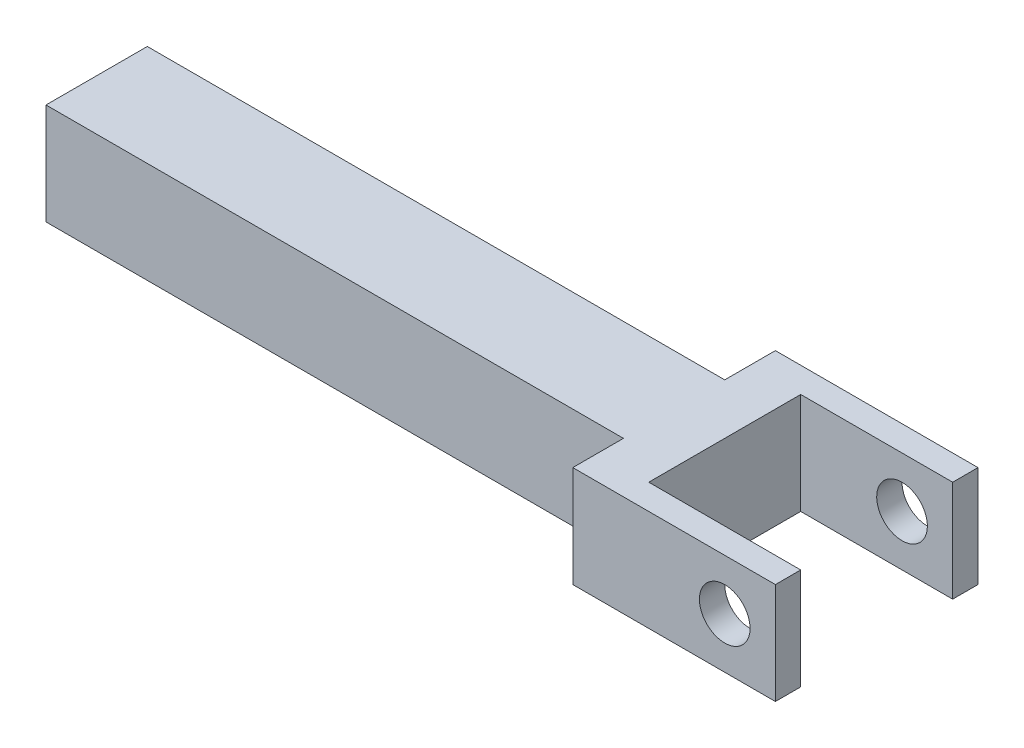
ISO-10303-21;
HEADER;
FILE_DESCRIPTION(('STEP AP214'),'2;1');
FILE_NAME('part.step','',(''),(''),'','','');
FILE_SCHEMA(('AUTOMOTIVE_DESIGN { 1 0 10303 214 1 1 1 1 }'));
ENDSEC;
DATA;
#1=APPLICATION_CONTEXT('core data for automotive mechanical design processes');
#2=APPLICATION_PROTOCOL_DEFINITION('international standard','automotive_design',2000,#1);
#3=PRODUCT_CONTEXT('',#1,'mechanical');
#4=PRODUCT('Part','Part','',(#3));
#5=PRODUCT_RELATED_PRODUCT_CATEGORY('part','',(#4));
#6=PRODUCT_DEFINITION_FORMATION('','',#4);
#7=PRODUCT_DEFINITION_CONTEXT('part definition',#1,'design');
#8=PRODUCT_DEFINITION('design','',#6,#7);
#9=PRODUCT_DEFINITION_SHAPE('','',#8);
#10=(LENGTH_UNIT() NAMED_UNIT(*) SI_UNIT(.MILLI.,.METRE.));
#11=(NAMED_UNIT(*) PLANE_ANGLE_UNIT() SI_UNIT($,.RADIAN.));
#12=(NAMED_UNIT(*) SI_UNIT($,.STERADIAN.) SOLID_ANGLE_UNIT());
#13=UNCERTAINTY_MEASURE_WITH_UNIT(LENGTH_MEASURE(1.E-05),#10,'distance_accuracy_value','');
#14=(GEOMETRIC_REPRESENTATION_CONTEXT(3) GLOBAL_UNCERTAINTY_ASSIGNED_CONTEXT((#13)) GLOBAL_UNIT_ASSIGNED_CONTEXT((#10,
#11,#12)) REPRESENTATION_CONTEXT('',''));
#15=CARTESIAN_POINT('',(0.,0.,0.));
#16=DIRECTION('',(0.,0.,1.));
#17=DIRECTION('',(1.,0.,0.));
#18=AXIS2_PLACEMENT_3D('',#15,#16,#17);
#19=CARTESIAN_POINT('',(38.5,0.,0.));
#20=DIRECTION('',(1.,0.,0.));
#21=DIRECTION('',(0.,1.,0.));
#22=AXIS2_PLACEMENT_3D('',#19,#20,#21);
#23=PLANE('',#22);
#24=DIRECTION('',(0.,1.,0.));
#25=VECTOR('',#24,1.);
#26=CARTESIAN_POINT('',(38.5,-2.5,-3.75));
#27=LINE('',#26,#25);
#28=CARTESIAN_POINT('',(38.5,-2.5,-3.75));
#29=VERTEX_POINT('',#28);
#30=CARTESIAN_POINT('',(38.5,2.5,-3.75));
#31=VERTEX_POINT('',#30);
#32=EDGE_CURVE('E11',#29,#31,#27,.T.);
#33=ORIENTED_EDGE('',*,*,#32,.F.);
#34=DIRECTION('',(0.,0.,-1.));
#35=VECTOR('',#34,1.);
#36=CARTESIAN_POINT('',(38.5,-2.5,5.));
#37=LINE('',#36,#35);
#38=CARTESIAN_POINT('',(38.5,-2.5,-5.));
#39=VERTEX_POINT('',#38);
#40=EDGE_CURVE('E25',#29,#39,#37,.T.);
#41=ORIENTED_EDGE('',*,*,#40,.T.);
#42=DIRECTION('',(0.,1.,0.));
#43=VECTOR('',#42,1.);
#44=CARTESIAN_POINT('',(38.5,-2.5,-5.));
#45=LINE('',#44,#43);
#46=CARTESIAN_POINT('',(38.5,2.5,-5.));
#47=VERTEX_POINT('',#46);
#48=EDGE_CURVE('E153',#39,#47,#45,.T.);
#49=ORIENTED_EDGE('',*,*,#48,.T.);
#50=DIRECTION('',(0.,0.,1.));
#51=VECTOR('',#50,1.);
#52=CARTESIAN_POINT('',(38.5,2.5,5.));
#53=LINE('',#52,#51);
#54=EDGE_CURVE('E240',#47,#31,#53,.T.);
#55=ORIENTED_EDGE('',*,*,#54,.T.);
#56=EDGE_LOOP('',(#33,#41,#49,#55));
#57=FACE_BOUND('',#56,.T.);
#58=ADVANCED_FACE('F17',(#57),#23,.T.);
#59=CARTESIAN_POINT('',(28.5,2.5,2.5));
#60=DIRECTION('',(0.,-1.,0.));
#61=DIRECTION('',(0.,0.,-1.));
#62=AXIS2_PLACEMENT_3D('',#59,#60,#61);
#63=PLANE('',#62);
#64=DIRECTION('',(0.,0.,1.));
#65=VECTOR('',#64,1.);
#66=CARTESIAN_POINT('',(31.,2.5,3.75));
#67=LINE('',#66,#65);
#68=CARTESIAN_POINT('',(31.,2.5,-3.75));
#69=VERTEX_POINT('',#68);
#70=CARTESIAN_POINT('',(31.,2.5,3.75));
#71=VERTEX_POINT('',#70);
#72=EDGE_CURVE('E236',#69,#71,#67,.T.);
#73=ORIENTED_EDGE('',*,*,#72,.F.);
#74=DIRECTION('',(1.,0.,0.));
#75=VECTOR('',#74,1.);
#76=CARTESIAN_POINT('',(31.,2.5,-3.75));
#77=LINE('',#76,#75);
#78=EDGE_CURVE('E232',#69,#31,#77,.T.);
#79=ORIENTED_EDGE('',*,*,#78,.T.);
#80=ORIENTED_EDGE('',*,*,#54,.F.);
#81=DIRECTION('',(-1.,0.,0.));
#82=VECTOR('',#81,1.);
#83=CARTESIAN_POINT('',(38.5,2.5,-5.));
#84=LINE('',#83,#82);
#85=CARTESIAN_POINT('',(28.5,2.5,-5.));
#86=VERTEX_POINT('',#85);
#87=EDGE_CURVE('E229',#47,#86,#84,.T.);
#88=ORIENTED_EDGE('',*,*,#87,.T.);
#89=DIRECTION('',(0.,0.,1.));
#90=VECTOR('',#89,1.);
#91=CARTESIAN_POINT('',(28.5,2.5,5.));
#92=LINE('',#91,#90);
#93=CARTESIAN_POINT('',(28.5,2.5,-2.5));
#94=VERTEX_POINT('',#93);
#95=EDGE_CURVE('E145',#86,#94,#92,.T.);
#96=ORIENTED_EDGE('',*,*,#95,.T.);
#97=DIRECTION('',(-1.,0.,0.));
#98=VECTOR('',#97,1.);
#99=CARTESIAN_POINT('',(28.5,2.5,-2.5));
#100=LINE('',#99,#98);
#101=CARTESIAN_POINT('',(0.,2.5,-2.5));
#102=VERTEX_POINT('',#101);
#103=EDGE_CURVE('E224',#94,#102,#100,.T.);
#104=ORIENTED_EDGE('',*,*,#103,.T.);
#105=DIRECTION('',(0.,0.,1.));
#106=VECTOR('',#105,1.);
#107=CARTESIAN_POINT('',(0.,2.5,2.5));
#108=LINE('',#107,#106);
#109=CARTESIAN_POINT('',(0.,2.5,2.5));
#110=VERTEX_POINT('',#109);
#111=EDGE_CURVE('E221',#102,#110,#108,.T.);
#112=ORIENTED_EDGE('',*,*,#111,.T.);
#113=DIRECTION('',(-1.,0.,0.));
#114=VECTOR('',#113,1.);
#115=CARTESIAN_POINT('',(28.5,2.5,2.5));
#116=LINE('',#115,#114);
#117=CARTESIAN_POINT('',(28.5,2.5,2.5));
#118=VERTEX_POINT('',#117);
#119=EDGE_CURVE('E217',#118,#110,#116,.T.);
#120=ORIENTED_EDGE('',*,*,#119,.F.);
#121=DIRECTION('',(0.,0.,1.));
#122=VECTOR('',#121,1.);
#123=CARTESIAN_POINT('',(28.5,2.5,5.));
#124=LINE('',#123,#122);
#125=CARTESIAN_POINT('',(28.5,2.5,5.));
#126=VERTEX_POINT('',#125);
#127=EDGE_CURVE('E214',#118,#126,#124,.T.);
#128=ORIENTED_EDGE('',*,*,#127,.T.);
#129=DIRECTION('',(-1.,0.,0.));
#130=VECTOR('',#129,1.);
#131=CARTESIAN_POINT('',(38.5,2.5,5.));
#132=LINE('',#131,#130);
#133=CARTESIAN_POINT('',(38.5,2.5,5.));
#134=VERTEX_POINT('',#133);
#135=EDGE_CURVE('E210',#134,#126,#132,.T.);
#136=ORIENTED_EDGE('',*,*,#135,.F.);
#137=DIRECTION('',(0.,0.,1.));
#138=VECTOR('',#137,1.);
#139=CARTESIAN_POINT('',(38.5,2.5,5.));
#140=LINE('',#139,#138);
#141=CARTESIAN_POINT('',(38.5,2.5,3.75));
#142=VERTEX_POINT('',#141);
#143=EDGE_CURVE('E206',#142,#134,#140,.T.);
#144=ORIENTED_EDGE('',*,*,#143,.F.);
#145=DIRECTION('',(1.,0.,0.));
#146=VECTOR('',#145,1.);
#147=CARTESIAN_POINT('',(31.,2.5,3.75));
#148=LINE('',#147,#146);
#149=EDGE_CURVE('E202',#71,#142,#148,.T.);
#150=ORIENTED_EDGE('',*,*,#149,.F.);
#151=EDGE_LOOP('',(#73,#79,#80,#88,#96,#104,#112,#120,#128,#136,#144,#150));
#152=FACE_BOUND('',#151,.T.);
#153=ADVANCED_FACE('F276',(#152),#63,.F.);
#154=CARTESIAN_POINT('',(28.5,-2.5,2.5));
#155=DIRECTION('',(0.,0.,-1.));
#156=DIRECTION('',(0.,1.,0.));
#157=AXIS2_PLACEMENT_3D('',#154,#155,#156);
#158=PLANE('',#157);
#159=DIRECTION('',(0.,-1.,0.));
#160=VECTOR('',#159,1.);
#161=CARTESIAN_POINT('',(0.,-2.5,2.5));
#162=LINE('',#161,#160);
#163=CARTESIAN_POINT('',(0.,-2.5,2.5));
#164=VERTEX_POINT('',#163);
#165=EDGE_CURVE('E199',#110,#164,#162,.T.);
#166=ORIENTED_EDGE('',*,*,#165,.T.);
#167=DIRECTION('',(-1.,0.,0.));
#168=VECTOR('',#167,1.);
#169=CARTESIAN_POINT('',(28.5,-2.5,2.5));
#170=LINE('',#169,#168);
#171=CARTESIAN_POINT('',(28.5,-2.5,2.5));
#172=VERTEX_POINT('',#171);
#173=EDGE_CURVE('E195',#172,#164,#170,.T.);
#174=ORIENTED_EDGE('',*,*,#173,.F.);
#175=DIRECTION('',(0.,-1.,0.));
#176=VECTOR('',#175,1.);
#177=CARTESIAN_POINT('',(28.5,-2.5,2.5));
#178=LINE('',#177,#176);
#179=EDGE_CURVE('E191',#118,#172,#178,.T.);
#180=ORIENTED_EDGE('',*,*,#179,.F.);
#181=ORIENTED_EDGE('',*,*,#119,.T.);
#182=EDGE_LOOP('',(#166,#174,#180,#181));
#183=FACE_BOUND('',#182,.T.);
#184=ADVANCED_FACE('F335',(#183),#158,.F.);
#185=CARTESIAN_POINT('',(28.5,-2.5,2.5));
#186=DIRECTION('',(0.,1.,0.));
#187=DIRECTION('',(0.,0.,1.));
#188=AXIS2_PLACEMENT_3D('',#185,#186,#187);
#189=PLANE('',#188);
#190=ORIENTED_EDGE('',*,*,#40,.F.);
#191=DIRECTION('',(1.,0.,0.));
#192=VECTOR('',#191,1.);
#193=CARTESIAN_POINT('',(31.,-2.5,-3.75));
#194=LINE('',#193,#192);
#195=CARTESIAN_POINT('',(31.,-2.5,-3.75));
#196=VERTEX_POINT('',#195);
#197=EDGE_CURVE('E187',#196,#29,#194,.T.);
#198=ORIENTED_EDGE('',*,*,#197,.F.);
#199=DIRECTION('',(0.,0.,-1.));
#200=VECTOR('',#199,1.);
#201=CARTESIAN_POINT('',(31.,-2.5,3.75));
#202=LINE('',#201,#200);
#203=CARTESIAN_POINT('',(31.,-2.5,3.75));
#204=VERTEX_POINT('',#203);
#205=EDGE_CURVE('E183',#204,#196,#202,.T.);
#206=ORIENTED_EDGE('',*,*,#205,.F.);
#207=DIRECTION('',(1.,0.,0.));
#208=VECTOR('',#207,1.);
#209=CARTESIAN_POINT('',(31.,-2.5,3.75));
#210=LINE('',#209,#208);
#211=CARTESIAN_POINT('',(38.5,-2.5,3.75));
#212=VERTEX_POINT('',#211);
#213=EDGE_CURVE('E180',#204,#212,#210,.T.);
#214=ORIENTED_EDGE('',*,*,#213,.T.);
#215=DIRECTION('',(0.,0.,-1.));
#216=VECTOR('',#215,1.);
#217=CARTESIAN_POINT('',(38.5,-2.5,5.));
#218=LINE('',#217,#216);
#219=CARTESIAN_POINT('',(38.5,-2.5,5.));
#220=VERTEX_POINT('',#219);
#221=EDGE_CURVE('E176',#220,#212,#218,.T.);
#222=ORIENTED_EDGE('',*,*,#221,.F.);
#223=DIRECTION('',(-1.,0.,0.));
#224=VECTOR('',#223,1.);
#225=CARTESIAN_POINT('',(38.5,-2.5,5.));
#226=LINE('',#225,#224);
#227=CARTESIAN_POINT('',(28.5,-2.5,5.));
#228=VERTEX_POINT('',#227);
#229=EDGE_CURVE('E173',#220,#228,#226,.T.);
#230=ORIENTED_EDGE('',*,*,#229,.T.);
#231=DIRECTION('',(0.,0.,-1.));
#232=VECTOR('',#231,1.);
#233=CARTESIAN_POINT('',(28.5,-2.5,5.));
#234=LINE('',#233,#232);
#235=EDGE_CURVE('E169',#228,#172,#234,.T.);
#236=ORIENTED_EDGE('',*,*,#235,.T.);
#237=ORIENTED_EDGE('',*,*,#173,.T.);
#238=DIRECTION('',(0.,0.,-1.));
#239=VECTOR('',#238,1.);
#240=CARTESIAN_POINT('',(0.,-2.5,2.5));
#241=LINE('',#240,#239);
#242=CARTESIAN_POINT('',(0.,-2.5,-2.5));
#243=VERTEX_POINT('',#242);
#244=EDGE_CURVE('E166',#164,#243,#241,.T.);
#245=ORIENTED_EDGE('',*,*,#244,.T.);
#246=DIRECTION('',(-1.,0.,0.));
#247=VECTOR('',#246,1.);
#248=CARTESIAN_POINT('',(28.5,-2.5,-2.5));
#249=LINE('',#248,#247);
#250=CARTESIAN_POINT('',(28.5,-2.5,-2.5));
#251=VERTEX_POINT('',#250);
#252=EDGE_CURVE('E135',#251,#243,#249,.T.);
#253=ORIENTED_EDGE('',*,*,#252,.F.);
#254=DIRECTION('',(0.,0.,-1.));
#255=VECTOR('',#254,1.);
#256=CARTESIAN_POINT('',(28.5,-2.5,5.));
#257=LINE('',#256,#255);
#258=CARTESIAN_POINT('',(28.5,-2.5,-5.));
#259=VERTEX_POINT('',#258);
#260=EDGE_CURVE('E128',#251,#259,#257,.T.);
#261=ORIENTED_EDGE('',*,*,#260,.T.);
#262=DIRECTION('',(-1.,0.,0.));
#263=VECTOR('',#262,1.);
#264=CARTESIAN_POINT('',(38.5,-2.5,-5.));
#265=LINE('',#264,#263);
#266=EDGE_CURVE('E132',#39,#259,#265,.T.);
#267=ORIENTED_EDGE('',*,*,#266,.F.);
#268=EDGE_LOOP('',(#190,#198,#206,#214,#222,#230,#236,#237,#245,#253,#261,#267));
#269=FACE_BOUND('',#268,.T.);
#270=ADVANCED_FACE('F130',(#269),#189,.F.);
#271=CARTESIAN_POINT('',(28.5,-2.5,-2.5));
#272=DIRECTION('',(0.,0.,1.));
#273=DIRECTION('',(0.,-1.,0.));
#274=AXIS2_PLACEMENT_3D('',#271,#272,#273);
#275=PLANE('',#274);
#276=DIRECTION('',(0.,1.,0.));
#277=VECTOR('',#276,1.);
#278=CARTESIAN_POINT('',(0.,-2.5,-2.5));
#279=LINE('',#278,#277);
#280=EDGE_CURVE('E155',#243,#102,#279,.T.);
#281=ORIENTED_EDGE('',*,*,#280,.T.);
#282=ORIENTED_EDGE('',*,*,#103,.F.);
#283=DIRECTION('',(0.,1.,0.));
#284=VECTOR('',#283,1.);
#285=CARTESIAN_POINT('',(28.5,-2.5,-2.5));
#286=LINE('',#285,#284);
#287=EDGE_CURVE('E160',#251,#94,#286,.T.);
#288=ORIENTED_EDGE('',*,*,#287,.F.);
#289=ORIENTED_EDGE('',*,*,#252,.T.);
#290=EDGE_LOOP('',(#281,#282,#288,#289));
#291=FACE_BOUND('',#290,.T.);
#292=ADVANCED_FACE('F328',(#291),#275,.F.);
#293=CARTESIAN_POINT('',(0.,0.,0.));
#294=DIRECTION('',(1.,0.,0.));
#295=DIRECTION('',(0.,1.,0.));
#296=AXIS2_PLACEMENT_3D('',#293,#294,#295);
#297=PLANE('',#296);
#298=ORIENTED_EDGE('',*,*,#111,.F.);
#299=ORIENTED_EDGE('',*,*,#280,.F.);
#300=ORIENTED_EDGE('',*,*,#244,.F.);
#301=ORIENTED_EDGE('',*,*,#165,.F.);
#302=EDGE_LOOP('',(#298,#299,#300,#301));
#303=FACE_BOUND('',#302,.T.);
#304=ADVANCED_FACE('F338',(#303),#297,.F.);
#305=CARTESIAN_POINT('',(28.5,0.,0.));
#306=DIRECTION('',(1.,0.,0.));
#307=DIRECTION('',(0.,1.,0.));
#308=AXIS2_PLACEMENT_3D('',#305,#306,#307);
#309=PLANE('',#308);
#310=ORIENTED_EDGE('',*,*,#127,.F.);
#311=ORIENTED_EDGE('',*,*,#179,.T.);
#312=ORIENTED_EDGE('',*,*,#235,.F.);
#313=DIRECTION('',(0.,-1.,0.));
#314=VECTOR('',#313,1.);
#315=CARTESIAN_POINT('',(28.5,-2.5,5.));
#316=LINE('',#315,#314);
#317=EDGE_CURVE('E149',#126,#228,#316,.T.);
#318=ORIENTED_EDGE('',*,*,#317,.F.);
#319=EDGE_LOOP('',(#310,#311,#312,#318));
#320=FACE_BOUND('',#319,.T.);
#321=ADVANCED_FACE('F343',(#320),#309,.F.);
#322=CARTESIAN_POINT('',(28.5,0.,0.));
#323=DIRECTION('',(1.,0.,0.));
#324=DIRECTION('',(0.,1.,0.));
#325=AXIS2_PLACEMENT_3D('',#322,#323,#324);
#326=PLANE('',#325);
#327=ORIENTED_EDGE('',*,*,#260,.F.);
#328=ORIENTED_EDGE('',*,*,#287,.T.);
#329=ORIENTED_EDGE('',*,*,#95,.F.);
#330=DIRECTION('',(0.,1.,0.));
#331=VECTOR('',#330,1.);
#332=CARTESIAN_POINT('',(28.5,-2.5,-5.));
#333=LINE('',#332,#331);
#334=EDGE_CURVE('E143',#259,#86,#333,.T.);
#335=ORIENTED_EDGE('',*,*,#334,.F.);
#336=EDGE_LOOP('',(#327,#328,#329,#335));
#337=FACE_BOUND('',#336,.T.);
#338=ADVANCED_FACE('F144',(#337),#326,.F.);
#339=CARTESIAN_POINT('',(38.5,-2.5,5.));
#340=DIRECTION('',(0.,0.,-1.));
#341=DIRECTION('',(0.,1.,0.));
#342=AXIS2_PLACEMENT_3D('',#339,#340,#341);
#343=PLANE('',#342);
#344=CARTESIAN_POINT('',(36.,0.,5.));
#345=DIRECTION('',(0.,0.,-1.));
#346=DIRECTION('',(0.,1.,0.));
#347=AXIS2_PLACEMENT_3D('',#344,#345,#346);
#348=CIRCLE('',#347,1.25);
#349=CARTESIAN_POINT('',(36.,1.25,5.));
#350=VERTEX_POINT('',#349);
#351=EDGE_CURVE('E150',#350,#350,#348,.T.);
#352=ORIENTED_EDGE('',*,*,#351,.T.);
#353=EDGE_LOOP('',(#352));
#354=FACE_BOUND('',#353,.T.);
#355=ORIENTED_EDGE('',*,*,#317,.T.);
#356=ORIENTED_EDGE('',*,*,#229,.F.);
#357=DIRECTION('',(0.,-1.,0.));
#358=VECTOR('',#357,1.);
#359=CARTESIAN_POINT('',(38.5,-2.5,5.));
#360=LINE('',#359,#358);
#361=EDGE_CURVE('E315',#134,#220,#360,.T.);
#362=ORIENTED_EDGE('',*,*,#361,.F.);
#363=ORIENTED_EDGE('',*,*,#135,.T.);
#364=EDGE_LOOP('',(#355,#356,#362,#363));
#365=FACE_BOUND('',#364,.T.);
#366=ADVANCED_FACE('F346',(#354,#365),#343,.F.);
#367=CARTESIAN_POINT('',(38.5,-2.5,-5.));
#368=DIRECTION('',(0.,0.,1.));
#369=DIRECTION('',(0.,-1.,0.));
#370=AXIS2_PLACEMENT_3D('',#367,#368,#369);
#371=PLANE('',#370);
#372=CARTESIAN_POINT('',(36.,0.,-5.));
#373=DIRECTION('',(0.,0.,1.));
#374=DIRECTION('',(0.,-1.,0.));
#375=AXIS2_PLACEMENT_3D('',#372,#373,#374);
#376=CIRCLE('',#375,1.25);
#377=CARTESIAN_POINT('',(36.,-1.25,-5.));
#378=VERTEX_POINT('',#377);
#379=EDGE_CURVE('E311',#378,#378,#376,.T.);
#380=ORIENTED_EDGE('',*,*,#379,.T.);
#381=EDGE_LOOP('',(#380));
#382=FACE_BOUND('',#381,.T.);
#383=ORIENTED_EDGE('',*,*,#334,.T.);
#384=ORIENTED_EDGE('',*,*,#87,.F.);
#385=ORIENTED_EDGE('',*,*,#48,.F.);
#386=ORIENTED_EDGE('',*,*,#266,.T.);
#387=EDGE_LOOP('',(#383,#384,#385,#386));
#388=FACE_BOUND('',#387,.T.);
#389=ADVANCED_FACE('F152',(#382,#388),#371,.F.);
#390=CARTESIAN_POINT('',(38.5,0.,0.));
#391=DIRECTION('',(1.,0.,0.));
#392=DIRECTION('',(0.,1.,0.));
#393=AXIS2_PLACEMENT_3D('',#390,#391,#392);
#394=PLANE('',#393);
#395=DIRECTION('',(0.,-1.,0.));
#396=VECTOR('',#395,1.);
#397=CARTESIAN_POINT('',(38.5,-2.5,3.75));
#398=LINE('',#397,#396);
#399=EDGE_CURVE('E292',#142,#212,#398,.T.);
#400=ORIENTED_EDGE('',*,*,#399,.F.);
#401=ORIENTED_EDGE('',*,*,#143,.T.);
#402=ORIENTED_EDGE('',*,*,#361,.T.);
#403=ORIENTED_EDGE('',*,*,#221,.T.);
#404=EDGE_LOOP('',(#400,#401,#402,#403));
#405=FACE_BOUND('',#404,.T.);
#406=ADVANCED_FACE('F348',(#405),#394,.T.);
#407=CARTESIAN_POINT('',(31.,-2.5,-3.75));
#408=DIRECTION('',(0.,0.,-1.));
#409=DIRECTION('',(0.,1.,0.));
#410=AXIS2_PLACEMENT_3D('',#407,#408,#409);
#411=PLANE('',#410);
#412=CARTESIAN_POINT('',(36.,0.,-3.75));
#413=DIRECTION('',(0.,0.,-1.));
#414=DIRECTION('',(0.,1.,0.));
#415=AXIS2_PLACEMENT_3D('',#412,#413,#414);
#416=CIRCLE('',#415,1.25);
#417=CARTESIAN_POINT('',(36.,1.25,-3.75));
#418=VERTEX_POINT('',#417);
#419=EDGE_CURVE('E305',#418,#418,#416,.T.);
#420=ORIENTED_EDGE('',*,*,#419,.T.);
#421=EDGE_LOOP('',(#420));
#422=FACE_BOUND('',#421,.T.);
#423=ORIENTED_EDGE('',*,*,#32,.T.);
#424=ORIENTED_EDGE('',*,*,#78,.F.);
#425=DIRECTION('',(0.,1.,0.));
#426=VECTOR('',#425,1.);
#427=CARTESIAN_POINT('',(31.,-2.5,-3.75));
#428=LINE('',#427,#426);
#429=EDGE_CURVE('E282',#196,#69,#428,.T.);
#430=ORIENTED_EDGE('',*,*,#429,.F.);
#431=ORIENTED_EDGE('',*,*,#197,.T.);
#432=EDGE_LOOP('',(#423,#424,#430,#431));
#433=FACE_BOUND('',#432,.T.);
#434=ADVANCED_FACE('F281',(#422,#433),#411,.F.);
#435=CARTESIAN_POINT('',(31.,-2.5,3.75));
#436=DIRECTION('',(0.,0.,1.));
#437=DIRECTION('',(0.,-1.,0.));
#438=AXIS2_PLACEMENT_3D('',#435,#436,#437);
#439=PLANE('',#438);
#440=CARTESIAN_POINT('',(36.,0.,3.75));
#441=DIRECTION('',(0.,0.,1.));
#442=DIRECTION('',(0.,-1.,0.));
#443=AXIS2_PLACEMENT_3D('',#440,#441,#442);
#444=CIRCLE('',#443,1.25);
#445=CARTESIAN_POINT('',(36.,-1.25,3.75));
#446=VERTEX_POINT('',#445);
#447=EDGE_CURVE('E295',#446,#446,#444,.T.);
#448=ORIENTED_EDGE('',*,*,#447,.T.);
#449=EDGE_LOOP('',(#448));
#450=FACE_BOUND('',#449,.T.);
#451=ORIENTED_EDGE('',*,*,#399,.T.);
#452=ORIENTED_EDGE('',*,*,#213,.F.);
#453=DIRECTION('',(0.,-1.,0.));
#454=VECTOR('',#453,1.);
#455=CARTESIAN_POINT('',(31.,-2.5,3.75));
#456=LINE('',#455,#454);
#457=EDGE_CURVE('E290',#71,#204,#456,.T.);
#458=ORIENTED_EDGE('',*,*,#457,.F.);
#459=ORIENTED_EDGE('',*,*,#149,.T.);
#460=EDGE_LOOP('',(#451,#452,#458,#459));
#461=FACE_BOUND('',#460,.T.);
#462=ADVANCED_FACE('F289',(#450,#461),#439,.F.);
#463=CARTESIAN_POINT('',(31.,0.,0.));
#464=DIRECTION('',(1.,0.,0.));
#465=DIRECTION('',(0.,1.,0.));
#466=AXIS2_PLACEMENT_3D('',#463,#464,#465);
#467=PLANE('',#466);
#468=ORIENTED_EDGE('',*,*,#72,.T.);
#469=ORIENTED_EDGE('',*,*,#457,.T.);
#470=ORIENTED_EDGE('',*,*,#205,.T.);
#471=ORIENTED_EDGE('',*,*,#429,.T.);
#472=EDGE_LOOP('',(#468,#469,#470,#471));
#473=FACE_BOUND('',#472,.T.);
#474=ADVANCED_FACE('F293',(#473),#467,.T.);
#475=CARTESIAN_POINT('',(36.,0.,5.));
#476=DIRECTION('',(0.,0.,-1.));
#477=DIRECTION('',(0.,1.,0.));
#478=AXIS2_PLACEMENT_3D('',#475,#476,#477);
#479=CYLINDRICAL_SURFACE('',#478,1.25);
#480=ORIENTED_EDGE('',*,*,#351,.F.);
#481=EDGE_LOOP('',(#480));
#482=FACE_BOUND('',#481,.T.);
#483=ORIENTED_EDGE('',*,*,#447,.F.);
#484=EDGE_LOOP('',(#483));
#485=FACE_BOUND('',#484,.T.);
#486=ADVANCED_FACE('F385',(#482,#485),#479,.F.);
#487=CARTESIAN_POINT('',(36.,0.,5.));
#488=DIRECTION('',(0.,0.,-1.));
#489=DIRECTION('',(0.,1.,0.));
#490=AXIS2_PLACEMENT_3D('',#487,#488,#489);
#491=CYLINDRICAL_SURFACE('',#490,1.25);
#492=ORIENTED_EDGE('',*,*,#419,.F.);
#493=EDGE_LOOP('',(#492));
#494=FACE_BOUND('',#493,.T.);
#495=ORIENTED_EDGE('',*,*,#379,.F.);
#496=EDGE_LOOP('',(#495));
#497=FACE_BOUND('',#496,.T.);
#498=ADVANCED_FACE('F388',(#494,#497),#491,.F.);
#499=CLOSED_SHELL('',(#58,#153,#184,#270,#292,#304,#321,#338,#366,#389,#406,#434,#462,#474,#486,#498));
#500=MANIFOLD_SOLID_BREP('B1',#499);
#501=ADVANCED_BREP_SHAPE_REPRESENTATION('',(#18,#500),#14);
#502=SHAPE_DEFINITION_REPRESENTATION(#9,#501);
ENDSEC;
END-ISO-10303-21;
